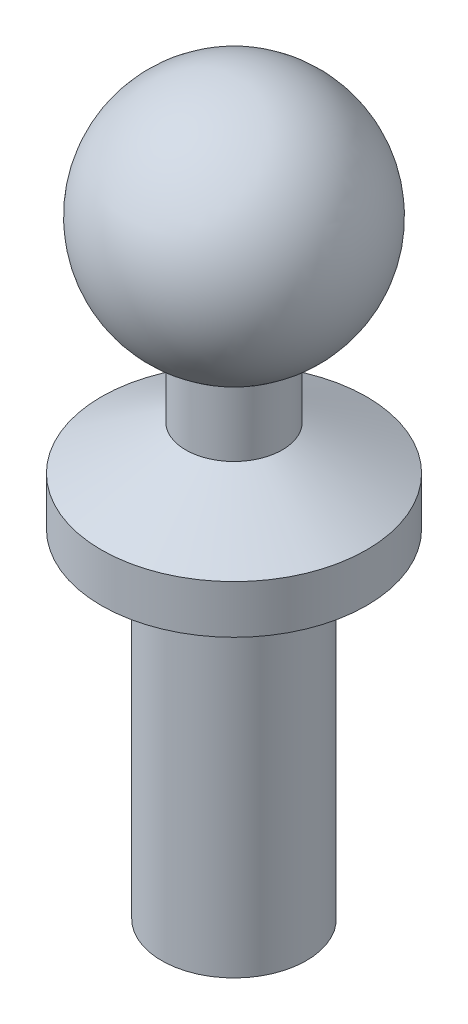
ISO-10303-21;
HEADER;
FILE_DESCRIPTION(('STEP AP214'),'2;1');
FILE_NAME('part.step','',(''),(''),'','','');
FILE_SCHEMA(('AUTOMOTIVE_DESIGN { 1 0 10303 214 1 1 1 1 }'));
ENDSEC;
DATA;
#1=APPLICATION_CONTEXT('core data for automotive mechanical design processes');
#2=APPLICATION_PROTOCOL_DEFINITION('international standard','automotive_design',2000,#1);
#3=PRODUCT_CONTEXT('',#1,'mechanical');
#4=PRODUCT('Part','Part','',(#3));
#5=PRODUCT_RELATED_PRODUCT_CATEGORY('part','',(#4));
#6=PRODUCT_DEFINITION_FORMATION('','',#4);
#7=PRODUCT_DEFINITION_CONTEXT('part definition',#1,'design');
#8=PRODUCT_DEFINITION('design','',#6,#7);
#9=PRODUCT_DEFINITION_SHAPE('','',#8);
#10=(LENGTH_UNIT() NAMED_UNIT(*) SI_UNIT(.MILLI.,.METRE.));
#11=(NAMED_UNIT(*) PLANE_ANGLE_UNIT() SI_UNIT($,.RADIAN.));
#12=(NAMED_UNIT(*) SI_UNIT($,.STERADIAN.) SOLID_ANGLE_UNIT());
#13=UNCERTAINTY_MEASURE_WITH_UNIT(LENGTH_MEASURE(1.E-05),#10,'distance_accuracy_value','');
#14=(GEOMETRIC_REPRESENTATION_CONTEXT(3) GLOBAL_UNCERTAINTY_ASSIGNED_CONTEXT((#13)) GLOBAL_UNIT_ASSIGNED_CONTEXT((#10,
#11,#12)) REPRESENTATION_CONTEXT('',''));
#15=CARTESIAN_POINT('',(0.,0.,0.));
#16=DIRECTION('',(0.,0.,1.));
#17=DIRECTION('',(1.,0.,0.));
#18=AXIS2_PLACEMENT_3D('',#15,#16,#17);
#19=CARTESIAN_POINT('',(0.,0.,0.));
#20=DIRECTION('',(0.,-1.,0.));
#21=DIRECTION('',(0.,0.,-1.));
#22=AXIS2_PLACEMENT_3D('',#19,#20,#21);
#23=PLANE('',#22);
#24=CARTESIAN_POINT('',(0.,0.,0.));
#25=DIRECTION('',(0.,-1.,0.));
#26=DIRECTION('',(0.,0.,-1.));
#27=AXIS2_PLACEMENT_3D('',#24,#25,#26);
#28=CIRCLE('',#27,1.5);
#29=CARTESIAN_POINT('',(0.,0.,-1.5));
#30=VERTEX_POINT('',#29);
#31=EDGE_CURVE('E10',#30,#30,#28,.T.);
#32=ORIENTED_EDGE('',*,*,#31,.T.);
#33=EDGE_LOOP('',(#32));
#34=FACE_BOUND('',#33,.T.);
#35=ADVANCED_FACE('F28',(#34),#23,.T.);
#36=CARTESIAN_POINT('',(0.,0.,0.));
#37=DIRECTION('',(0.,-1.,0.));
#38=DIRECTION('',(0.,0.,-1.));
#39=AXIS2_PLACEMENT_3D('',#36,#37,#38);
#40=CYLINDRICAL_SURFACE('',#39,1.5);
#41=CARTESIAN_POINT('',(0.,7.,0.));
#42=DIRECTION('',(0.,-1.,0.));
#43=DIRECTION('',(0.,0.,-1.));
#44=AXIS2_PLACEMENT_3D('',#41,#42,#43);
#45=CIRCLE('',#44,1.5);
#46=CARTESIAN_POINT('',(0.,7.,-1.5));
#47=VERTEX_POINT('',#46);
#48=EDGE_CURVE('E34',#47,#47,#45,.T.);
#49=ORIENTED_EDGE('',*,*,#48,.T.);
#50=EDGE_LOOP('',(#49));
#51=FACE_BOUND('',#50,.T.);
#52=ORIENTED_EDGE('',*,*,#31,.F.);
#53=EDGE_LOOP('',(#52));
#54=FACE_BOUND('',#53,.T.);
#55=ADVANCED_FACE('F66',(#51,#54),#40,.T.);
#56=CARTESIAN_POINT('',(1.5,7.,0.));
#57=DIRECTION('',(0.,-1.,0.));
#58=DIRECTION('',(0.,0.,-1.));
#59=AXIS2_PLACEMENT_3D('',#56,#57,#58);
#60=PLANE('',#59);
#61=CARTESIAN_POINT('',(0.,7.,0.));
#62=DIRECTION('',(0.,-1.,0.));
#63=DIRECTION('',(0.,0.,-1.));
#64=AXIS2_PLACEMENT_3D('',#61,#62,#63);
#65=CIRCLE('',#64,2.75);
#66=CARTESIAN_POINT('',(0.,7.,-2.75));
#67=VERTEX_POINT('',#66);
#68=EDGE_CURVE('E38',#67,#67,#65,.T.);
#69=ORIENTED_EDGE('',*,*,#68,.T.);
#70=EDGE_LOOP('',(#69));
#71=FACE_BOUND('',#70,.T.);
#72=ORIENTED_EDGE('',*,*,#48,.F.);
#73=EDGE_LOOP('',(#72));
#74=FACE_BOUND('',#73,.T.);
#75=ADVANCED_FACE('F70',(#71,#74),#60,.T.);
#76=CARTESIAN_POINT('',(0.,0.,0.));
#77=DIRECTION('',(0.,-1.,0.));
#78=DIRECTION('',(0.,0.,-1.));
#79=AXIS2_PLACEMENT_3D('',#76,#77,#78);
#80=CYLINDRICAL_SURFACE('',#79,2.75);
#81=CARTESIAN_POINT('',(0.,8.,0.));
#82=DIRECTION('',(0.,-1.,0.));
#83=DIRECTION('',(0.,0.,-1.));
#84=AXIS2_PLACEMENT_3D('',#81,#82,#83);
#85=CIRCLE('',#84,2.75);
#86=CARTESIAN_POINT('',(0.,8.,-2.75));
#87=VERTEX_POINT('',#86);
#88=EDGE_CURVE('E42',#87,#87,#85,.T.);
#89=ORIENTED_EDGE('',*,*,#88,.T.);
#90=EDGE_LOOP('',(#89));
#91=FACE_BOUND('',#90,.T.);
#92=ORIENTED_EDGE('',*,*,#68,.F.);
#93=EDGE_LOOP('',(#92));
#94=FACE_BOUND('',#93,.T.);
#95=ADVANCED_FACE('F74',(#91,#94),#80,.T.);
#96=CARTESIAN_POINT('',(0.,8.,0.));
#97=DIRECTION('',(0.,-1.,0.));
#98=DIRECTION('',(0.,0.,-1.));
#99=AXIS2_PLACEMENT_3D('',#96,#97,#98);
#100=CONICAL_SURFACE('',#99,2.75,1.08736627952284);
#101=CARTESIAN_POINT('',(0.,8.91871215252208,0.));
#102=DIRECTION('',(0.,-1.,0.));
#103=DIRECTION('',(0.,0.,-1.));
#104=AXIS2_PLACEMENT_3D('',#101,#102,#103);
#105=CIRCLE('',#104,1.);
#106=CARTESIAN_POINT('',(0.,8.91871215252208,-1.));
#107=VERTEX_POINT('',#106);
#108=EDGE_CURVE('E47',#107,#107,#105,.T.);
#109=ORIENTED_EDGE('',*,*,#108,.T.);
#110=EDGE_LOOP('',(#109));
#111=FACE_BOUND('',#110,.T.);
#112=ORIENTED_EDGE('',*,*,#88,.F.);
#113=EDGE_LOOP('',(#112));
#114=FACE_BOUND('',#113,.T.);
#115=ADVANCED_FACE('F63',(#111,#114),#100,.T.);
#116=CARTESIAN_POINT('',(0.,0.,0.));
#117=DIRECTION('',(0.,-1.,0.));
#118=DIRECTION('',(0.,0.,-1.));
#119=AXIS2_PLACEMENT_3D('',#116,#117,#118);
#120=CYLINDRICAL_SURFACE('',#119,1.);
#121=CARTESIAN_POINT('',(0.,10.3187121525221,0.));
#122=DIRECTION('',(0.,-1.,0.));
#123=DIRECTION('',(0.,0.,-1.));
#124=AXIS2_PLACEMENT_3D('',#121,#122,#123);
#125=CIRCLE('',#124,1.);
#126=CARTESIAN_POINT('',(0.,10.3187121525221,-1.));
#127=VERTEX_POINT('',#126);
#128=EDGE_CURVE('E50',#127,#127,#125,.T.);
#129=ORIENTED_EDGE('',*,*,#128,.T.);
#130=EDGE_LOOP('',(#129));
#131=FACE_BOUND('',#130,.T.);
#132=ORIENTED_EDGE('',*,*,#108,.F.);
#133=EDGE_LOOP('',(#132));
#134=FACE_BOUND('',#133,.T.);
#135=ADVANCED_FACE('F54',(#131,#134),#120,.T.);
#136=CARTESIAN_POINT('',(0.,12.61,0.));
#137=DIRECTION('',(0.,-1.,0.));
#138=DIRECTION('',(1.,0.,0.));
#139=AXIS2_PLACEMENT_3D('',#136,#137,#138);
#140=SPHERICAL_SURFACE('',#139,2.5);
#141=ORIENTED_EDGE('',*,*,#128,.F.);
#142=EDGE_LOOP('',(#141));
#143=FACE_BOUND('',#142,.T.);
#144=ADVANCED_FACE('F57',(#143),#140,.T.);
#145=CLOSED_SHELL('',(#35,#55,#75,#95,#115,#135,#144));
#146=MANIFOLD_SOLID_BREP('B2',#145);
#147=ADVANCED_BREP_SHAPE_REPRESENTATION('',(#18,#146),#14);
#148=SHAPE_DEFINITION_REPRESENTATION(#9,#147);
ENDSEC;
END-ISO-10303-21;
